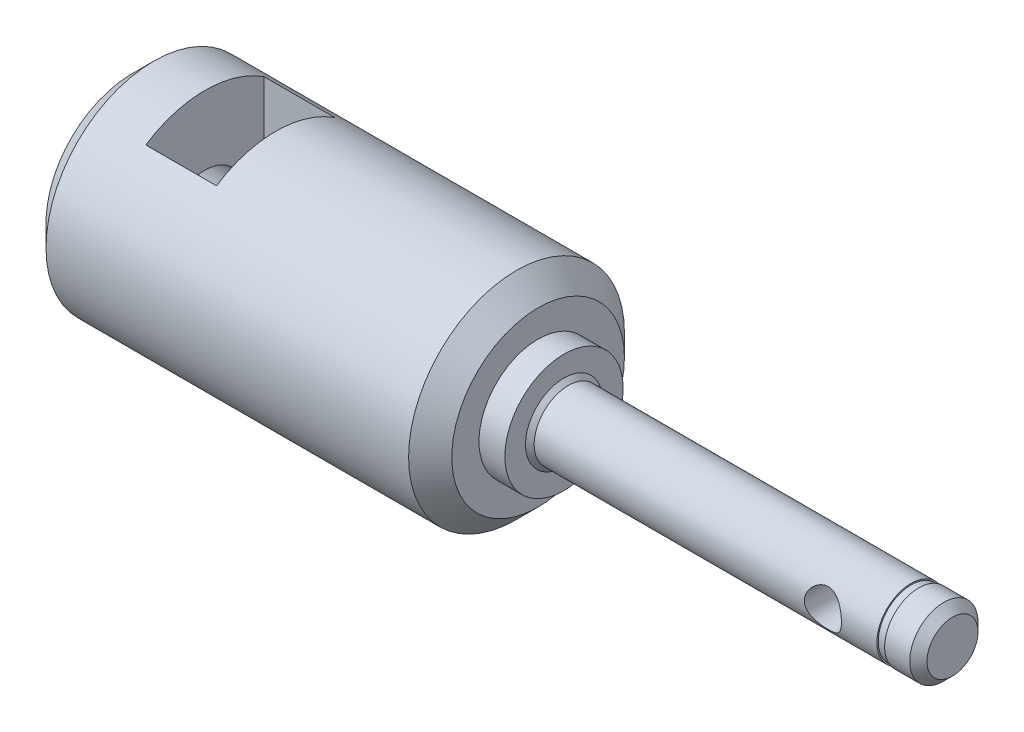
ISO-10303-21;
HEADER;
FILE_DESCRIPTION(('STEP AP214'),'2;1');
FILE_NAME('part.step','',(''),(''),'','','');
FILE_SCHEMA(('AUTOMOTIVE_DESIGN { 1 0 10303 214 1 1 1 1 }'));
ENDSEC;
DATA;
#1=APPLICATION_CONTEXT('core data for automotive mechanical design processes');
#2=APPLICATION_PROTOCOL_DEFINITION('international standard','automotive_design',2000,#1);
#3=PRODUCT_CONTEXT('',#1,'mechanical');
#4=PRODUCT('Part','Part','',(#3));
#5=PRODUCT_RELATED_PRODUCT_CATEGORY('part','',(#4));
#6=PRODUCT_DEFINITION_FORMATION('','',#4);
#7=PRODUCT_DEFINITION_CONTEXT('part definition',#1,'design');
#8=PRODUCT_DEFINITION('design','',#6,#7);
#9=PRODUCT_DEFINITION_SHAPE('','',#8);
#10=(LENGTH_UNIT() NAMED_UNIT(*) SI_UNIT(.MILLI.,.METRE.));
#11=(NAMED_UNIT(*) PLANE_ANGLE_UNIT() SI_UNIT($,.RADIAN.));
#12=(NAMED_UNIT(*) SI_UNIT($,.STERADIAN.) SOLID_ANGLE_UNIT());
#13=UNCERTAINTY_MEASURE_WITH_UNIT(LENGTH_MEASURE(1.E-05),#10,'distance_accuracy_value','');
#14=(GEOMETRIC_REPRESENTATION_CONTEXT(3) GLOBAL_UNCERTAINTY_ASSIGNED_CONTEXT((#13)) GLOBAL_UNIT_ASSIGNED_CONTEXT((#10,
#11,#12)) REPRESENTATION_CONTEXT('',''));
#15=CARTESIAN_POINT('',(0.,0.,0.));
#16=DIRECTION('',(0.,0.,1.));
#17=DIRECTION('',(1.,0.,0.));
#18=AXIS2_PLACEMENT_3D('',#15,#16,#17);
#19=CARTESIAN_POINT('',(45.,0.,0.));
#20=DIRECTION('',(-1.,0.,0.));
#21=DIRECTION('',(0.,0.,1.));
#22=AXIS2_PLACEMENT_3D('',#19,#20,#21);
#23=CYLINDRICAL_SURFACE('',#22,3.955);
#24=CARTESIAN_POINT('',(0.500000000000084,0.,0.));
#25=DIRECTION('',(1.,0.,0.));
#26=DIRECTION('',(0.,0.,-1.));
#27=AXIS2_PLACEMENT_3D('',#24,#25,#26);
#28=CIRCLE('',#27,3.955);
#29=CARTESIAN_POINT('',(0.500000000000084,0.,-3.955));
#30=VERTEX_POINT('',#29);
#31=EDGE_CURVE('E54',#30,#30,#28,.T.);
#32=ORIENTED_EDGE('',*,*,#31,.T.);
#33=EDGE_LOOP('',(#32));
#34=FACE_BOUND('',#33,.T.);
#35=CARTESIAN_POINT('',(36.09,0.,-3.955));
#36=CARTESIAN_POINT('',(36.0899913353575,0.11181063584012,-3.95499243223975));
#37=CARTESIAN_POINT('',(36.0812265055163,0.223723051403326,-3.95020937629344));
#38=CARTESIAN_POINT('',(36.0465883434407,0.444161006607524,-3.93154366621352));
#39=CARTESIAN_POINT('',(36.0206904459152,0.552681448543805,-3.91764794664675));
#40=CARTESIAN_POINT('',(35.9531374952778,0.762830990051214,-3.88219353760298));
#41=CARTESIAN_POINT('',(35.911546938014,0.864486315383245,-3.86066623505247));
#42=CARTESIAN_POINT('',(35.8141660617234,1.05917985222398,-3.8118567187839));
#43=CARTESIAN_POINT('',(35.7583753388594,1.15221781856178,-3.78457434140157));
#44=CARTESIAN_POINT('',(35.6299227092596,1.3341245832591,-3.72450288446028));
#45=CARTESIAN_POINT('',(35.5563737134341,1.42228360140012,-3.69146592463258));
#46=CARTESIAN_POINT('',(35.3964292445123,1.58568614584837,-3.62428543995537));
#47=CARTESIAN_POINT('',(35.3100221871021,1.66091789241436,-3.59014093920025));
#48=CARTESIAN_POINT('',(35.1169958420553,1.80359088411455,-3.52078940686454));
#49=CARTESIAN_POINT('',(35.0092336694647,1.86959797538891,-3.485793302945));
#50=CARTESIAN_POINT('',(34.7820063815533,1.9823056543699,-3.42296478861619));
#51=CARTESIAN_POINT('',(34.6625505408779,2.02902139166791,-3.39512676344169));
#52=CARTESIAN_POINT('',(34.4810748145664,2.08168106318247,-3.36288675129095));
#53=CARTESIAN_POINT('',(34.4222244334382,2.09610457644942,-3.35388823998415));
#54=CARTESIAN_POINT('',(34.3031643669255,2.11997390775354,-3.33885276912193));
#55=CARTESIAN_POINT('',(34.2429554933086,2.1294226204195,-3.33281408750678));
#56=CARTESIAN_POINT('',(34.1217682113817,2.14316944226478,-3.32399123212969));
#57=CARTESIAN_POINT('',(34.0607905489024,2.14747220552278,-3.32120411765464));
#58=CARTESIAN_POINT('',(33.9386501903377,2.1508686265174,-3.31900416954366));
#59=CARTESIAN_POINT('',(33.8774875194549,2.14996296441426,-3.31959089532314));
#60=CARTESIAN_POINT('',(33.7126975564287,2.1404709285362,-3.32573159418689));
#61=CARTESIAN_POINT('',(33.6094216945788,2.12693600133354,-3.33448537855423));
#62=CARTESIAN_POINT('',(33.4069986736786,2.08545408607942,-3.36057770955324));
#63=CARTESIAN_POINT('',(33.3078533269552,2.05750084227053,-3.37791998239114));
#64=CARTESIAN_POINT('',(33.1136567999618,1.98759647891917,-3.41952718762628));
#65=CARTESIAN_POINT('',(33.0187432451249,1.94535158906127,-3.44393570955849));
#66=CARTESIAN_POINT('',(32.8368702211833,1.84830880363638,-3.4969749528188));
#67=CARTESIAN_POINT('',(32.749914249567,1.79350542513589,-3.52560751637823));
#68=CARTESIAN_POINT('',(32.5723634542071,1.6631262215664,-3.58915894932989));
#69=CARTESIAN_POINT('',(32.4832604626013,1.58565285730952,-3.62436795415648));
#70=CARTESIAN_POINT('',(32.318625704345,1.41688194526972,-3.69361570126591));
#71=CARTESIAN_POINT('',(32.2431028297316,1.32557541131796,-3.7276536650618));
#72=CARTESIAN_POINT('',(32.1031228757089,1.12442363848674,-3.79335994355921));
#73=CARTESIAN_POINT('',(32.0396856626446,1.01376515088264,-3.82473643042661));
#74=CARTESIAN_POINT('',(31.9328850447521,0.781226880662589,-3.87890580520184));
#75=CARTESIAN_POINT('',(31.8895031297434,0.659357570243086,-3.90170660446289));
#76=CARTESIAN_POINT('',(31.8281078635875,0.419836128447885,-3.93433672282033));
#77=CARTESIAN_POINT('',(31.8081292500945,0.302825989676947,-3.94516569464654));
#78=CARTESIAN_POINT('',(31.7877728989182,0.066640695557453,-3.95620092179831));
#79=CARTESIAN_POINT('',(31.7873831060668,-0.0525330830842293,-3.9564137104351));
#80=CARTESIAN_POINT('',(31.8052912257121,-0.277559441251307,-3.94670329600794));
#81=CARTESIAN_POINT('',(31.8218171553956,-0.383601906852055,-3.93774118322879));
#82=CARTESIAN_POINT('',(31.8701193119344,-0.591141057732675,-3.91197066844202));
#83=CARTESIAN_POINT('',(31.9018970980258,-0.692637277078039,-3.89516146421104));
#84=CARTESIAN_POINT('',(31.980358084972,-0.891042890832165,-3.8546813162091));
#85=CARTESIAN_POINT('',(32.0273735192684,-0.987788788416986,-3.83085862832163));
#86=CARTESIAN_POINT('',(32.1345494279513,-1.17228135833838,-3.77849068500266));
#87=CARTESIAN_POINT('',(32.1947148369907,-1.26002463414359,-3.74994365769704));
#88=CARTESIAN_POINT('',(32.3340794541026,-1.43433181403964,-3.68703398140593));
#89=CARTESIAN_POINT('',(32.4146464102445,-1.51969707849559,-3.65237720005062));
#90=CARTESIAN_POINT('',(32.5886582765177,-1.67633547839038,-3.58319298844329));
#91=CARTESIAN_POINT('',(32.682115890799,-1.74759454089766,-3.54866572074452));
#92=CARTESIAN_POINT('',(32.8876960787111,-1.87912647833076,-3.4809162278637));
#93=CARTESIAN_POINT('',(33.0006864061808,-1.93820358392112,-3.44797743718148));
#94=CARTESIAN_POINT('',(33.2372706957762,-2.03592465619749,-3.39120413797061));
#95=CARTESIAN_POINT('',(33.3608490026322,-2.07459820538148,-3.36735646251482));
#96=CARTESIAN_POINT('',(33.6023990173185,-2.12655968614989,-3.33476103055512));
#97=CARTESIAN_POINT('',(33.7197424307738,-2.14195524051053,-3.32476763700887));
#98=CARTESIAN_POINT('',(33.9557182809619,-2.15317732122058,-3.31751632632435));
#99=CARTESIAN_POINT('',(34.0743496316829,-2.14901922389583,-3.3202484022941));
#100=CARTESIAN_POINT('',(34.2930343973038,-2.1232966448781,-3.33673532602036));
#101=CARTESIAN_POINT('',(34.3934928174628,-2.10407315582721,-3.34900603341765));
#102=CARTESIAN_POINT('',(34.5895483405185,-2.05204284441452,-3.38113510836181));
#103=CARTESIAN_POINT('',(34.6851435113652,-2.0192306701929,-3.40099646522341));
#104=CARTESIAN_POINT('',(34.8754876201626,-1.93873842034259,-3.44754988602101));
#105=CARTESIAN_POINT('',(34.9698086546846,-1.89025593293933,-3.4745918269835));
#106=CARTESIAN_POINT('',(35.1496094857022,-1.78057590832574,-3.53205456016513));
#107=CARTESIAN_POINT('',(35.2350845142385,-1.71937156700555,-3.56247715641279));
#108=CARTESIAN_POINT('',(35.4083476014451,-1.57512298129353,-3.62880417108258));
#109=CARTESIAN_POINT('',(35.4945090954418,-1.4901726832347,-3.6648384125703));
#110=CARTESIAN_POINT('',(35.6518812494208,-1.30637771687642,-3.73431058475788));
#111=CARTESIAN_POINT('',(35.7230815976057,-1.2075235433219,-3.7677467148012));
#112=CARTESIAN_POINT('',(35.8503368356612,-0.994446237578294,-3.82958415086532));
#113=CARTESIAN_POINT('',(35.9058619288541,-0.879845532965877,-3.85780020047228));
#114=CARTESIAN_POINT('',(35.9735423539584,-0.700916263962817,-3.89287304099152));
#115=CARTESIAN_POINT('',(35.9934942364712,-0.640139091272302,-3.90335146920138));
#116=CARTESIAN_POINT('',(36.0279748190733,-0.516681582141075,-3.9216000285076));
#117=CARTESIAN_POINT('',(36.0425064235906,-0.454002284472228,-3.92937160990568));
#118=CARTESIAN_POINT('',(36.0660709104973,-0.326468355543275,-3.94203018655783));
#119=CARTESIAN_POINT('',(36.07502919714,-0.261595977584929,-3.94687802395789));
#120=CARTESIAN_POINT('',(36.086996276686,-0.131160742943252,-3.95336514689983));
#121=CARTESIAN_POINT('',(36.0900050834363,-0.0655978878673112,-3.95500443990935));
#122=CARTESIAN_POINT('',(36.09,0.,-3.955));
#123=B_SPLINE_CURVE_WITH_KNOTS('',3,(#35,#36,#37,#38,#39,#40,#41,#42,#43,#44,#45,#46,#47,#48,
#49,#50,#51,#52,#53,#54,#55,#56,#57,#58,#59,#60,#61,#62,#63,#64,#65,#66,#67,#68,#69,#70,#71,#72,
#73,#74,#75,#76,#77,#78,#79,#80,#81,#82,#83,#84,#85,#86,#87,#88,#89,#90,#91,#92,#93,#94,#95,#96,
#97,#98,#99,#100,#101,#102,#103,#104,#105,#106,#107,#108,#109,#110,#111,#112,#113,#114,#115,
#116,#117,#118,#119,#120,#121,#122),.UNSPECIFIED.,.T.,.F.,(4,2,2,2,2,2,2,2,2,2,2,2,2,2,2,2,2,2,
2,2,2,2,2,2,2,2,2,2,2,2,2,2,2,2,2,2,2,2,2,2,2,2,2,4),(0.,0.335177404027916,0.670836428009941,
1.00513068131345,1.33943444264215,1.69639264403375,2.05367441176158,2.44514150195075,
2.83630058386944,3.01983248829485,3.20325748482003,3.38651646309838,3.56975151041227,
3.88170355660521,4.19379106520801,4.51272852526939,4.8318054970117,5.19988178048584,
5.56819820352995,5.96012796481195,6.35169526596605,6.70727127261125,7.06262845132601,
7.38422347765053,7.70585138845994,8.03502569712529,8.36432374431173,8.72996039758541,
9.09596000686924,9.48891726744081,9.88130321451063,10.2354278926941,10.5892741458767,
10.8969693720011,11.2047858983196,11.5318792974725,11.8591480902893,12.2362077578757,
12.6135264631718,13.0023848616934,13.1965889059074,13.3906887368724,13.5873335441659,
13.7839778937832),.UNSPECIFIED.);
#124=CARTESIAN_POINT('',(36.09,0.,-3.955));
#125=VERTEX_POINT('',#124);
#126=EDGE_CURVE('E128',#125,#125,#123,.T.);
#127=ORIENTED_EDGE('',*,*,#126,.T.);
#128=EDGE_LOOP('',(#127));
#129=FACE_BOUND('',#128,.T.);
#130=CARTESIAN_POINT('',(36.09,0.,3.955));
#131=CARTESIAN_POINT('',(36.0899913353575,-0.111810635840121,3.95499243223975));
#132=CARTESIAN_POINT('',(36.0812265055163,-0.223723051403327,3.95020937629344));
#133=CARTESIAN_POINT('',(36.0465883434407,-0.444161006607525,3.93154366621352));
#134=CARTESIAN_POINT('',(36.0206904459152,-0.552681448543806,3.91764794664675));
#135=CARTESIAN_POINT('',(35.9531374952778,-0.762830990051215,3.88219353760298));
#136=CARTESIAN_POINT('',(35.911546938014,-0.864486315383247,3.86066623505247));
#137=CARTESIAN_POINT('',(35.8141660617234,-1.05917985222398,3.8118567187839));
#138=CARTESIAN_POINT('',(35.7583753388594,-1.15221781856178,3.78457434140157));
#139=CARTESIAN_POINT('',(35.6299227092596,-1.3341245832591,3.72450288446028));
#140=CARTESIAN_POINT('',(35.5563737134341,-1.42228360140012,3.69146592463258));
#141=CARTESIAN_POINT('',(35.3964292445123,-1.58568614584837,3.62428543995537));
#142=CARTESIAN_POINT('',(35.3100221871021,-1.66091789241436,3.59014093920025));
#143=CARTESIAN_POINT('',(35.1169958420553,-1.80359088411455,3.52078940686454));
#144=CARTESIAN_POINT('',(35.0092336694647,-1.86959797538891,3.485793302945));
#145=CARTESIAN_POINT('',(34.7820063815533,-1.98230565436991,3.42296478861619));
#146=CARTESIAN_POINT('',(34.6625505408779,-2.02902139166791,3.39512676344169));
#147=CARTESIAN_POINT('',(34.4810748145664,-2.08168106318247,3.36288675129095));
#148=CARTESIAN_POINT('',(34.4222244334382,-2.09610457644942,3.35388823998414));
#149=CARTESIAN_POINT('',(34.3031643669255,-2.11997390775355,3.33885276912193));
#150=CARTESIAN_POINT('',(34.2429554933086,-2.12942262041951,3.33281408750678));
#151=CARTESIAN_POINT('',(34.1217682113817,-2.14316944226478,3.32399123212969));
#152=CARTESIAN_POINT('',(34.0607905489024,-2.14747220552279,3.32120411765463));
#153=CARTESIAN_POINT('',(33.9386501903377,-2.1508686265174,3.31900416954366));
#154=CARTESIAN_POINT('',(33.8774875194549,-2.14996296441426,3.31959089532314));
#155=CARTESIAN_POINT('',(33.7126975564287,-2.1404709285362,3.32573159418689));
#156=CARTESIAN_POINT('',(33.6094216945788,-2.12693600133355,3.33448537855423));
#157=CARTESIAN_POINT('',(33.4069986736786,-2.08545408607942,3.36057770955324));
#158=CARTESIAN_POINT('',(33.3078533269552,-2.05750084227054,3.37791998239114));
#159=CARTESIAN_POINT('',(33.1136567999618,-1.98759647891917,3.41952718762628));
#160=CARTESIAN_POINT('',(33.0187432451249,-1.94535158906127,3.44393570955849));
#161=CARTESIAN_POINT('',(32.8368702211833,-1.84830880363639,3.4969749528188));
#162=CARTESIAN_POINT('',(32.749914249567,-1.79350542513589,3.52560751637823));
#163=CARTESIAN_POINT('',(32.5723634542071,-1.6631262215664,3.58915894932989));
#164=CARTESIAN_POINT('',(32.4832604626013,-1.58565285730952,3.62436795415648));
#165=CARTESIAN_POINT('',(32.3186257043449,-1.41688194526972,3.69361570126591));
#166=CARTESIAN_POINT('',(32.2431028297316,-1.32557541131796,3.7276536650618));
#167=CARTESIAN_POINT('',(32.1031228757089,-1.12442363848675,3.79335994355921));
#168=CARTESIAN_POINT('',(32.0396856626446,-1.01376515088265,3.82473643042661));
#169=CARTESIAN_POINT('',(31.9328850447521,-0.781226880662598,3.87890580520184));
#170=CARTESIAN_POINT('',(31.8895031297435,-0.659357570243095,3.90170660446289));
#171=CARTESIAN_POINT('',(31.8281078635875,-0.419836128447894,3.93433672282032));
#172=CARTESIAN_POINT('',(31.8081292500945,-0.302825989676956,3.94516569464654));
#173=CARTESIAN_POINT('',(31.7877728989182,-0.0666406955574617,3.95620092179831));
#174=CARTESIAN_POINT('',(31.7873831060668,0.0525330830842215,3.9564137104351));
#175=CARTESIAN_POINT('',(31.8052912257121,0.2775594412513,3.94670329600794));
#176=CARTESIAN_POINT('',(31.8218171553956,0.383601906852049,3.93774118322879));
#177=CARTESIAN_POINT('',(31.8701193119344,0.59114105773267,3.91197066844202));
#178=CARTESIAN_POINT('',(31.9018970980258,0.692637277078033,3.89516146421104));
#179=CARTESIAN_POINT('',(31.980358084972,0.891042890832162,3.8546813162091));
#180=CARTESIAN_POINT('',(32.0273735192684,0.987788788416985,3.83085862832163));
#181=CARTESIAN_POINT('',(32.1345494279513,1.17228135833838,3.77849068500266));
#182=CARTESIAN_POINT('',(32.1947148369907,1.26002463414358,3.74994365769705));
#183=CARTESIAN_POINT('',(32.3340794541026,1.43433181403963,3.68703398140593));
#184=CARTESIAN_POINT('',(32.4146464102445,1.51969707849558,3.65237720005062));
#185=CARTESIAN_POINT('',(32.5886582765177,1.67633547839038,3.58319298844329));
#186=CARTESIAN_POINT('',(32.682115890799,1.74759454089765,3.54866572074452));
#187=CARTESIAN_POINT('',(32.8876960787111,1.87912647833075,3.4809162278637));
#188=CARTESIAN_POINT('',(33.0006864061808,1.93820358392111,3.44797743718148));
#189=CARTESIAN_POINT('',(33.2372706957762,2.03592465619748,3.39120413797061));
#190=CARTESIAN_POINT('',(33.3608490026322,2.07459820538148,3.36735646251482));
#191=CARTESIAN_POINT('',(33.6023990173185,2.12655968614988,3.33476103055512));
#192=CARTESIAN_POINT('',(33.7197424307738,2.14195524051053,3.32476763700887));
#193=CARTESIAN_POINT('',(33.9557182809619,2.15317732122058,3.31751632632435));
#194=CARTESIAN_POINT('',(34.0743496316829,2.14901922389583,3.3202484022941));
#195=CARTESIAN_POINT('',(34.2930343973038,2.1232966448781,3.33673532602036));
#196=CARTESIAN_POINT('',(34.3934928174628,2.10407315582721,3.34900603341765));
#197=CARTESIAN_POINT('',(34.5895483405185,2.05204284441451,3.38113510836181));
#198=CARTESIAN_POINT('',(34.6851435113652,2.01923067019289,3.40099646522341));
#199=CARTESIAN_POINT('',(34.8754876201626,1.93873842034259,3.44754988602101));
#200=CARTESIAN_POINT('',(34.9698086546846,1.89025593293933,3.4745918269835));
#201=CARTESIAN_POINT('',(35.1496094857022,1.78057590832574,3.53205456016513));
#202=CARTESIAN_POINT('',(35.2350845142385,1.71937156700555,3.56247715641279));
#203=CARTESIAN_POINT('',(35.4083476014451,1.57512298129353,3.62880417108258));
#204=CARTESIAN_POINT('',(35.4945090954418,1.4901726832347,3.66483841257029));
#205=CARTESIAN_POINT('',(35.6518812494208,1.30637771687642,3.73431058475787));
#206=CARTESIAN_POINT('',(35.7230815976057,1.2075235433219,3.7677467148012));
#207=CARTESIAN_POINT('',(35.8503368356612,0.99444623757829,3.82958415086532));
#208=CARTESIAN_POINT('',(35.9058619288541,0.879845532965872,3.85780020047228));
#209=CARTESIAN_POINT('',(35.9735423539584,0.700916263962813,3.89287304099152));
#210=CARTESIAN_POINT('',(35.9934942364712,0.640139091272298,3.90335146920138));
#211=CARTESIAN_POINT('',(36.0279748190733,0.516681582141072,3.9216000285076));
#212=CARTESIAN_POINT('',(36.0425064235906,0.454002284472225,3.92937160990568));
#213=CARTESIAN_POINT('',(36.0660709104973,0.326468355543273,3.94203018655783));
#214=CARTESIAN_POINT('',(36.07502919714,0.261595977584927,3.94687802395789));
#215=CARTESIAN_POINT('',(36.086996276686,0.13116074294325,3.95336514689983));
#216=CARTESIAN_POINT('',(36.0900050834363,0.0655978878673097,3.95500443990936));
#217=CARTESIAN_POINT('',(36.09,0.,3.955));
#218=B_SPLINE_CURVE_WITH_KNOTS('',3,(#130,#131,#132,#133,#134,#135,#136,#137,#138,#139,#140,
#141,#142,#143,#144,#145,#146,#147,#148,#149,#150,#151,#152,#153,#154,#155,#156,#157,#158,#159,
#160,#161,#162,#163,#164,#165,#166,#167,#168,#169,#170,#171,#172,#173,#174,#175,#176,#177,#178,
#179,#180,#181,#182,#183,#184,#185,#186,#187,#188,#189,#190,#191,#192,#193,#194,#195,#196,#197,
#198,#199,#200,#201,#202,#203,#204,#205,#206,#207,#208,#209,#210,#211,#212,#213,#214,#215,#216,
#217),.UNSPECIFIED.,.T.,.F.,(4,2,2,2,2,2,2,2,2,2,2,2,2,2,2,2,2,2,2,2,2,2,2,2,2,2,2,2,2,2,2,2,2,
2,2,2,2,2,2,2,2,2,2,4),(0.,0.335177404027916,0.670836428009941,1.00513068131345,
1.33943444264216,1.69639264403375,2.05367441176159,2.44514150195075,2.83630058386944,
3.01983248829486,3.20325748482004,3.38651646309838,3.56975151041227,3.88170355660521,
4.19379106520801,4.51272852526939,4.8318054970117,5.19988178048585,5.56819820352995,
5.96012796481194,6.35169526596604,6.70727127261125,7.06262845132601,7.38422347765053,
7.70585138845994,8.0350256971253,8.36432374431173,8.72996039758542,9.09596000686924,
9.48891726744081,9.88130321451063,10.2354278926941,10.5892741458767,10.8969693720011,
11.2047858983196,11.5318792974725,11.8591480902893,12.2362077578757,12.6135264631718,
13.0023848616934,13.1965889059074,13.3906887368725,13.5873335441659,13.7839778937832),.UNSPECIFIED.);
#219=CARTESIAN_POINT('',(36.09,0.,3.955));
#220=VERTEX_POINT('',#219);
#221=EDGE_CURVE('E127',#220,#220,#218,.T.);
#222=ORIENTED_EDGE('',*,*,#221,.T.);
#223=EDGE_LOOP('',(#222));
#224=FACE_BOUND('',#223,.T.);
#225=CARTESIAN_POINT('',(40.2,0.,0.));
#226=DIRECTION('',(1.,0.,0.));
#227=DIRECTION('',(0.,0.,-1.));
#228=AXIS2_PLACEMENT_3D('',#225,#226,#227);
#229=CIRCLE('',#228,3.955);
#230=CARTESIAN_POINT('',(40.2,0.,-3.955));
#231=VERTEX_POINT('',#230);
#232=EDGE_CURVE('E116',#231,#231,#229,.T.);
#233=ORIENTED_EDGE('',*,*,#232,.F.);
#234=EDGE_LOOP('',(#233));
#235=FACE_BOUND('',#234,.T.);
#236=ADVANCED_FACE('F45',(#34,#129,#224,#235),#23,.T.);
#237=CARTESIAN_POINT('',(-50.,0.,0.));
#238=DIRECTION('',(1.,0.,0.));
#239=DIRECTION('',(0.,0.,-1.));
#240=AXIS2_PLACEMENT_3D('',#237,#238,#239);
#241=CYLINDRICAL_SURFACE('',#240,12.5);
#242=CARTESIAN_POINT('',(-41.6,0.,0.));
#243=DIRECTION('',(-1.,0.,0.));
#244=DIRECTION('',(0.,0.,1.));
#245=AXIS2_PLACEMENT_3D('',#242,#243,#244);
#246=CIRCLE('',#245,12.5);
#247=CARTESIAN_POINT('',(-41.6,-10.4559791507061,6.85));
#248=VERTEX_POINT('',#247);
#249=CARTESIAN_POINT('',(-41.6,-10.4559791507061,-6.85));
#250=VERTEX_POINT('',#249);
#251=EDGE_CURVE('E99',#248,#250,#246,.F.);
#252=ORIENTED_EDGE('',*,*,#251,.F.);
#253=DIRECTION('',(1.,0.,0.));
#254=VECTOR('',#253,1.);
#255=CARTESIAN_POINT('',(-50.,-10.4559791507061,6.85));
#256=LINE('',#255,#254);
#257=CARTESIAN_POINT('',(-33.4,-10.4559791507061,6.85));
#258=VERTEX_POINT('',#257);
#259=EDGE_CURVE('E212',#258,#248,#256,.F.);
#260=ORIENTED_EDGE('',*,*,#259,.F.);
#261=CARTESIAN_POINT('',(-33.4,0.,0.));
#262=DIRECTION('',(1.,0.,0.));
#263=DIRECTION('',(0.,0.,-1.));
#264=AXIS2_PLACEMENT_3D('',#261,#262,#263);
#265=CIRCLE('',#264,12.5);
#266=CARTESIAN_POINT('',(-33.4,-10.4559791507061,-6.85));
#267=VERTEX_POINT('',#266);
#268=EDGE_CURVE('E208',#267,#258,#265,.F.);
#269=ORIENTED_EDGE('',*,*,#268,.F.);
#270=DIRECTION('',(1.,0.,0.));
#271=VECTOR('',#270,1.);
#272=CARTESIAN_POINT('',(-50.,-10.4559791507061,-6.85));
#273=LINE('',#272,#271);
#274=EDGE_CURVE('E210',#250,#267,#273,.T.);
#275=ORIENTED_EDGE('',*,*,#274,.F.);
#276=EDGE_LOOP('',(#252,#260,#269,#275));
#277=FACE_BOUND('',#276,.T.);
#278=CARTESIAN_POINT('',(-41.6,10.4559791507061,-6.85));
#279=VERTEX_POINT('',#278);
#280=CARTESIAN_POINT('',(-41.6,10.4559791507061,6.85));
#281=VERTEX_POINT('',#280);
#282=EDGE_CURVE('E88',#279,#281,#246,.F.);
#283=ORIENTED_EDGE('',*,*,#282,.F.);
#284=DIRECTION('',(1.,0.,0.));
#285=VECTOR('',#284,1.);
#286=CARTESIAN_POINT('',(-50.,10.4559791507061,-6.85));
#287=LINE('',#286,#285);
#288=CARTESIAN_POINT('',(-33.4,10.4559791507061,-6.85));
#289=VERTEX_POINT('',#288);
#290=EDGE_CURVE('E91',#289,#279,#287,.F.);
#291=ORIENTED_EDGE('',*,*,#290,.F.);
#292=CARTESIAN_POINT('',(-33.4,10.4559791507061,6.85));
#293=VERTEX_POINT('',#292);
#294=EDGE_CURVE('E101',#293,#289,#265,.F.);
#295=ORIENTED_EDGE('',*,*,#294,.F.);
#296=DIRECTION('',(1.,0.,0.));
#297=VECTOR('',#296,1.);
#298=CARTESIAN_POINT('',(-50.,10.4559791507061,6.85));
#299=LINE('',#298,#297);
#300=EDGE_CURVE('E93',#281,#293,#299,.T.);
#301=ORIENTED_EDGE('',*,*,#300,.F.);
#302=EDGE_LOOP('',(#283,#291,#295,#301));
#303=FACE_BOUND('',#302,.T.);
#304=CARTESIAN_POINT('',(-5.49999999999999,0.,0.));
#305=DIRECTION('',(1.,0.,0.));
#306=DIRECTION('',(0.,0.,-1.));
#307=AXIS2_PLACEMENT_3D('',#304,#305,#306);
#308=CIRCLE('',#307,12.5);
#309=CARTESIAN_POINT('',(-5.49999999999999,0.,-12.5));
#310=VERTEX_POINT('',#309);
#311=EDGE_CURVE('E200',#310,#310,#308,.F.);
#312=ORIENTED_EDGE('',*,*,#311,.T.);
#313=EDGE_LOOP('',(#312));
#314=FACE_BOUND('',#313,.T.);
#315=CARTESIAN_POINT('',(-47.5,0.,0.));
#316=DIRECTION('',(1.,0.,0.));
#317=DIRECTION('',(0.,0.,-1.));
#318=AXIS2_PLACEMENT_3D('',#315,#316,#317);
#319=CIRCLE('',#318,12.5);
#320=CARTESIAN_POINT('',(-47.5,0.,-12.5));
#321=VERTEX_POINT('',#320);
#322=EDGE_CURVE('E123',#321,#321,#319,.T.);
#323=ORIENTED_EDGE('',*,*,#322,.T.);
#324=EDGE_LOOP('',(#323));
#325=FACE_BOUND('',#324,.T.);
#326=ADVANCED_FACE('F89',(#277,#303,#314,#325),#241,.T.);
#327=CARTESIAN_POINT('',(-50.,0.,0.));
#328=DIRECTION('',(1.,0.,0.));
#329=DIRECTION('',(0.,0.,-1.));
#330=AXIS2_PLACEMENT_3D('',#327,#328,#329);
#331=PLANE('',#330);
#332=CARTESIAN_POINT('',(-50.,0.,0.));
#333=DIRECTION('',(-1.,0.,0.));
#334=DIRECTION('',(0.,0.,1.));
#335=AXIS2_PLACEMENT_3D('',#332,#333,#334);
#336=CIRCLE('',#335,4.5);
#337=CARTESIAN_POINT('',(-50.,0.,4.5));
#338=VERTEX_POINT('',#337);
#339=EDGE_CURVE('E223',#338,#338,#336,.T.);
#340=ORIENTED_EDGE('',*,*,#339,.F.);
#341=EDGE_LOOP('',(#340));
#342=FACE_BOUND('',#341,.T.);
#343=CARTESIAN_POINT('',(-50.,0.,0.));
#344=DIRECTION('',(1.,0.,0.));
#345=DIRECTION('',(0.,0.,-1.));
#346=AXIS2_PLACEMENT_3D('',#343,#344,#345);
#347=CIRCLE('',#346,10.);
#348=CARTESIAN_POINT('',(-50.,0.,-10.));
#349=VERTEX_POINT('',#348);
#350=EDGE_CURVE('E194',#349,#349,#347,.F.);
#351=ORIENTED_EDGE('',*,*,#350,.T.);
#352=EDGE_LOOP('',(#351));
#353=FACE_BOUND('',#352,.T.);
#354=ADVANCED_FACE('F175',(#342,#353),#331,.F.);
#355=CARTESIAN_POINT('',(-3.,0.,0.));
#356=DIRECTION('',(1.,0.,0.));
#357=DIRECTION('',(0.,0.,-1.));
#358=AXIS2_PLACEMENT_3D('',#355,#356,#357);
#359=PLANE('',#358);
#360=CARTESIAN_POINT('',(-3.,0.,0.));
#361=DIRECTION('',(1.,0.,0.));
#362=DIRECTION('',(0.,0.,-1.));
#363=AXIS2_PLACEMENT_3D('',#360,#361,#362);
#364=CIRCLE('',#363,10.);
#365=CARTESIAN_POINT('',(-3.,0.,-10.));
#366=VERTEX_POINT('',#365);
#367=EDGE_CURVE('E197',#366,#366,#364,.T.);
#368=ORIENTED_EDGE('',*,*,#367,.T.);
#369=EDGE_LOOP('',(#368));
#370=FACE_BOUND('',#369,.T.);
#371=CARTESIAN_POINT('',(-3.,0.,0.));
#372=DIRECTION('',(1.,0.,0.));
#373=DIRECTION('',(0.,0.,-1.));
#374=AXIS2_PLACEMENT_3D('',#371,#372,#373);
#375=CIRCLE('',#374,6.85);
#376=CARTESIAN_POINT('',(-3.,0.,-6.85));
#377=VERTEX_POINT('',#376);
#378=EDGE_CURVE('E120',#377,#377,#375,.T.);
#379=ORIENTED_EDGE('',*,*,#378,.F.);
#380=EDGE_LOOP('',(#379));
#381=FACE_BOUND('',#380,.T.);
#382=ADVANCED_FACE('F289',(#370,#381),#359,.T.);
#383=CARTESIAN_POINT('',(-3.,0.,0.));
#384=DIRECTION('',(1.,0.,0.));
#385=DIRECTION('',(0.,0.,-1.));
#386=AXIS2_PLACEMENT_3D('',#383,#384,#385);
#387=CYLINDRICAL_SURFACE('',#386,6.85);
#388=ORIENTED_EDGE('',*,*,#378,.T.);
#389=EDGE_LOOP('',(#388));
#390=FACE_BOUND('',#389,.T.);
#391=CARTESIAN_POINT('',(0.,0.,0.));
#392=DIRECTION('',(1.,0.,0.));
#393=DIRECTION('',(0.,0.,-1.));
#394=AXIS2_PLACEMENT_3D('',#391,#392,#393);
#395=CIRCLE('',#394,6.85);
#396=CARTESIAN_POINT('',(0.,0.,-6.85));
#397=VERTEX_POINT('',#396);
#398=EDGE_CURVE('E124',#397,#397,#395,.T.);
#399=ORIENTED_EDGE('',*,*,#398,.F.);
#400=EDGE_LOOP('',(#399));
#401=FACE_BOUND('',#400,.T.);
#402=ADVANCED_FACE('F294',(#390,#401),#387,.T.);
#403=CARTESIAN_POINT('',(0.,0.,0.));
#404=DIRECTION('',(1.,0.,0.));
#405=DIRECTION('',(0.,0.,-1.));
#406=AXIS2_PLACEMENT_3D('',#403,#404,#405);
#407=PLANE('',#406);
#408=CARTESIAN_POINT('',(0.,0.,0.));
#409=DIRECTION('',(1.,0.,0.));
#410=DIRECTION('',(0.,0.,-1.));
#411=AXIS2_PLACEMENT_3D('',#408,#409,#410);
#412=CIRCLE('',#411,4.45500000000008);
#413=CARTESIAN_POINT('',(0.,0.,-4.45500000000008));
#414=VERTEX_POINT('',#413);
#415=EDGE_CURVE('E12',#414,#414,#412,.F.);
#416=ORIENTED_EDGE('',*,*,#415,.T.);
#417=EDGE_LOOP('',(#416));
#418=FACE_BOUND('',#417,.T.);
#419=ORIENTED_EDGE('',*,*,#398,.T.);
#420=EDGE_LOOP('',(#419));
#421=FACE_BOUND('',#420,.T.);
#422=ADVANCED_FACE('F150',(#418,#421),#407,.T.);
#423=CARTESIAN_POINT('',(33.94,0.,-12.5));
#424=DIRECTION('',(0.,0.,1.));
#425=DIRECTION('',(1.,0.,0.));
#426=AXIS2_PLACEMENT_3D('',#423,#424,#425);
#427=CYLINDRICAL_SURFACE('',#426,2.15);
#428=ORIENTED_EDGE('',*,*,#126,.F.);
#429=EDGE_LOOP('',(#428));
#430=FACE_BOUND('',#429,.T.);
#431=ORIENTED_EDGE('',*,*,#221,.F.);
#432=EDGE_LOOP('',(#431));
#433=FACE_BOUND('',#432,.T.);
#434=ADVANCED_FACE('F145',(#430,#433),#427,.F.);
#435=CARTESIAN_POINT('',(41.1,0.,0.));
#436=DIRECTION('',(1.,0.,0.));
#437=DIRECTION('',(0.,0.,-1.));
#438=AXIS2_PLACEMENT_3D('',#435,#436,#437);
#439=PLANE('',#438);
#440=CARTESIAN_POINT('',(41.1,0.,0.));
#441=DIRECTION('',(1.,0.,0.));
#442=DIRECTION('',(0.,0.,-1.));
#443=AXIS2_PLACEMENT_3D('',#440,#441,#442);
#444=CIRCLE('',#443,3.8);
#445=CARTESIAN_POINT('',(41.1,0.,-3.8));
#446=VERTEX_POINT('',#445);
#447=EDGE_CURVE('E113',#446,#446,#444,.T.);
#448=ORIENTED_EDGE('',*,*,#447,.T.);
#449=EDGE_LOOP('',(#448));
#450=FACE_BOUND('',#449,.T.);
#451=CARTESIAN_POINT('',(41.1,0.,0.));
#452=DIRECTION('',(1.,0.,0.));
#453=DIRECTION('',(0.,0.,-1.));
#454=AXIS2_PLACEMENT_3D('',#451,#452,#453);
#455=CIRCLE('',#454,3.955);
#456=CARTESIAN_POINT('',(41.1,0.,-3.955));
#457=VERTEX_POINT('',#456);
#458=EDGE_CURVE('E136',#457,#457,#455,.T.);
#459=ORIENTED_EDGE('',*,*,#458,.F.);
#460=EDGE_LOOP('',(#459));
#461=FACE_BOUND('',#460,.T.);
#462=ADVANCED_FACE('F149',(#450,#461),#439,.F.);
#463=CARTESIAN_POINT('',(40.2,0.,0.));
#464=DIRECTION('',(1.,0.,0.));
#465=DIRECTION('',(0.,0.,-1.));
#466=AXIS2_PLACEMENT_3D('',#463,#464,#465);
#467=PLANE('',#466);
#468=CARTESIAN_POINT('',(40.2,0.,0.));
#469=DIRECTION('',(1.,0.,0.));
#470=DIRECTION('',(0.,0.,-1.));
#471=AXIS2_PLACEMENT_3D('',#468,#469,#470);
#472=CIRCLE('',#471,3.8);
#473=CARTESIAN_POINT('',(40.2,0.,-3.8));
#474=VERTEX_POINT('',#473);
#475=EDGE_CURVE('E117',#474,#474,#472,.T.);
#476=ORIENTED_EDGE('',*,*,#475,.F.);
#477=EDGE_LOOP('',(#476));
#478=FACE_BOUND('',#477,.T.);
#479=ORIENTED_EDGE('',*,*,#232,.T.);
#480=EDGE_LOOP('',(#479));
#481=FACE_BOUND('',#480,.T.);
#482=ADVANCED_FACE('F152',(#478,#481),#467,.T.);
#483=CARTESIAN_POINT('',(41.1,0.,0.));
#484=DIRECTION('',(-1.,0.,0.));
#485=DIRECTION('',(0.,0.,1.));
#486=AXIS2_PLACEMENT_3D('',#483,#484,#485);
#487=CYLINDRICAL_SURFACE('',#486,3.8);
#488=ORIENTED_EDGE('',*,*,#447,.F.);
#489=EDGE_LOOP('',(#488));
#490=FACE_BOUND('',#489,.T.);
#491=ORIENTED_EDGE('',*,*,#475,.T.);
#492=EDGE_LOOP('',(#491));
#493=FACE_BOUND('',#492,.T.);
#494=ADVANCED_FACE('F157',(#490,#493),#487,.T.);
#495=CARTESIAN_POINT('',(45.,0.,0.));
#496=DIRECTION('',(1.,0.,0.));
#497=DIRECTION('',(0.,0.,-1.));
#498=AXIS2_PLACEMENT_3D('',#495,#496,#497);
#499=PLANE('',#498);
#500=CARTESIAN_POINT('',(45.,0.,0.));
#501=DIRECTION('',(1.,0.,0.));
#502=DIRECTION('',(0.,0.,-1.));
#503=AXIS2_PLACEMENT_3D('',#500,#501,#502);
#504=CIRCLE('',#503,2.95500000000004);
#505=CARTESIAN_POINT('',(45.,0.,-2.95500000000004));
#506=VERTEX_POINT('',#505);
#507=EDGE_CURVE('E203',#506,#506,#504,.T.);
#508=ORIENTED_EDGE('',*,*,#507,.T.);
#509=EDGE_LOOP('',(#508));
#510=FACE_BOUND('',#509,.T.);
#511=ADVANCED_FACE('F154',(#510),#499,.T.);
#512=CARTESIAN_POINT('',(44.,0.,0.));
#513=DIRECTION('',(1.,0.,0.));
#514=DIRECTION('',(0.,0.,-1.));
#515=AXIS2_PLACEMENT_3D('',#512,#513,#514);
#516=CIRCLE('',#515,3.955);
#517=CARTESIAN_POINT('',(44.,0.,-3.955));
#518=VERTEX_POINT('',#517);
#519=EDGE_CURVE('E97',#518,#518,#516,.F.);
#520=ORIENTED_EDGE('',*,*,#519,.T.);
#521=EDGE_LOOP('',(#520));
#522=FACE_BOUND('',#521,.T.);
#523=ORIENTED_EDGE('',*,*,#458,.T.);
#524=EDGE_LOOP('',(#523));
#525=FACE_BOUND('',#524,.T.);
#526=ADVANCED_FACE('F141',(#522,#525),#23,.T.);
#527=CARTESIAN_POINT('',(-47.5,0.,0.));
#528=DIRECTION('',(1.,0.,0.));
#529=DIRECTION('',(0.,0.,-1.));
#530=AXIS2_PLACEMENT_3D('',#527,#528,#529);
#531=CONICAL_SURFACE('',#530,12.5,0.785398163397451);
#532=ORIENTED_EDGE('',*,*,#350,.F.);
#533=EDGE_LOOP('',(#532));
#534=FACE_BOUND('',#533,.T.);
#535=ORIENTED_EDGE('',*,*,#322,.F.);
#536=EDGE_LOOP('',(#535));
#537=FACE_BOUND('',#536,.T.);
#538=ADVANCED_FACE('F163',(#534,#537),#531,.T.);
#539=CARTESIAN_POINT('',(-3.,0.,0.));
#540=DIRECTION('',(-1.,0.,0.));
#541=DIRECTION('',(0.,0.,1.));
#542=AXIS2_PLACEMENT_3D('',#539,#540,#541);
#543=CONICAL_SURFACE('',#542,10.,0.785398163397449);
#544=ORIENTED_EDGE('',*,*,#311,.F.);
#545=EDGE_LOOP('',(#544));
#546=FACE_BOUND('',#545,.T.);
#547=ORIENTED_EDGE('',*,*,#367,.F.);
#548=EDGE_LOOP('',(#547));
#549=FACE_BOUND('',#548,.T.);
#550=ADVANCED_FACE('F280',(#546,#549),#543,.T.);
#551=CARTESIAN_POINT('',(45.,0.,0.));
#552=DIRECTION('',(-1.,0.,0.));
#553=DIRECTION('',(0.,0.,1.));
#554=AXIS2_PLACEMENT_3D('',#551,#552,#553);
#555=CONICAL_SURFACE('',#554,2.95500000000004,0.785398163397449);
#556=ORIENTED_EDGE('',*,*,#519,.F.);
#557=EDGE_LOOP('',(#556));
#558=FACE_BOUND('',#557,.T.);
#559=ORIENTED_EDGE('',*,*,#507,.F.);
#560=EDGE_LOOP('',(#559));
#561=FACE_BOUND('',#560,.T.);
#562=ADVANCED_FACE('F243',(#558,#561),#555,.T.);
#563=CARTESIAN_POINT('',(-33.4,-12.5,6.85));
#564=DIRECTION('',(1.,0.,0.));
#565=DIRECTION('',(0.,0.,-1.));
#566=AXIS2_PLACEMENT_3D('',#563,#564,#565);
#567=PLANE('',#566);
#568=CARTESIAN_POINT('',(-33.4,0.,0.));
#569=DIRECTION('',(1.,0.,0.));
#570=DIRECTION('',(0.,0.,-1.));
#571=AXIS2_PLACEMENT_3D('',#568,#569,#570);
#572=CIRCLE('',#571,4.5);
#573=CARTESIAN_POINT('',(-33.4,0.,-4.5));
#574=VERTEX_POINT('',#573);
#575=EDGE_CURVE('E109',#574,#574,#572,.T.);
#576=ORIENTED_EDGE('',*,*,#575,.T.);
#577=EDGE_LOOP('',(#576));
#578=FACE_BOUND('',#577,.T.);
#579=DIRECTION('',(0.,1.,0.));
#580=VECTOR('',#579,1.);
#581=CARTESIAN_POINT('',(-33.4,-12.5,-6.85));
#582=LINE('',#581,#580);
#583=EDGE_CURVE('E66',#267,#289,#582,.T.);
#584=ORIENTED_EDGE('',*,*,#583,.F.);
#585=ORIENTED_EDGE('',*,*,#268,.T.);
#586=DIRECTION('',(0.,1.,0.));
#587=VECTOR('',#586,1.);
#588=CARTESIAN_POINT('',(-33.4,-12.5,6.85));
#589=LINE('',#588,#587);
#590=EDGE_CURVE('E107',#258,#293,#589,.T.);
#591=ORIENTED_EDGE('',*,*,#590,.T.);
#592=ORIENTED_EDGE('',*,*,#294,.T.);
#593=EDGE_LOOP('',(#584,#585,#591,#592));
#594=FACE_BOUND('',#593,.T.);
#595=ADVANCED_FACE('F232',(#578,#594),#567,.F.);
#596=CARTESIAN_POINT('',(-41.6,-12.5,6.85));
#597=DIRECTION('',(0.,0.,1.));
#598=DIRECTION('',(1.,0.,0.));
#599=AXIS2_PLACEMENT_3D('',#596,#597,#598);
#600=PLANE('',#599);
#601=ORIENTED_EDGE('',*,*,#259,.T.);
#602=DIRECTION('',(0.,1.,0.));
#603=VECTOR('',#602,1.);
#604=CARTESIAN_POINT('',(-41.6,-12.5,6.85));
#605=LINE('',#604,#603);
#606=EDGE_CURVE('E105',#248,#281,#605,.T.);
#607=ORIENTED_EDGE('',*,*,#606,.T.);
#608=ORIENTED_EDGE('',*,*,#300,.T.);
#609=ORIENTED_EDGE('',*,*,#590,.F.);
#610=EDGE_LOOP('',(#601,#607,#608,#609));
#611=FACE_BOUND('',#610,.T.);
#612=ADVANCED_FACE('F235',(#611),#600,.F.);
#613=CARTESIAN_POINT('',(-41.6,-12.5,6.85));
#614=DIRECTION('',(-1.,0.,0.));
#615=DIRECTION('',(0.,0.,1.));
#616=AXIS2_PLACEMENT_3D('',#613,#614,#615);
#617=PLANE('',#616);
#618=CARTESIAN_POINT('',(-41.6,0.,0.));
#619=DIRECTION('',(-1.,0.,0.));
#620=DIRECTION('',(0.,0.,1.));
#621=AXIS2_PLACEMENT_3D('',#618,#619,#620);
#622=CIRCLE('',#621,4.5);
#623=CARTESIAN_POINT('',(-41.6,0.,4.5));
#624=VERTEX_POINT('',#623);
#625=EDGE_CURVE('E215',#624,#624,#622,.T.);
#626=ORIENTED_EDGE('',*,*,#625,.T.);
#627=EDGE_LOOP('',(#626));
#628=FACE_BOUND('',#627,.T.);
#629=ORIENTED_EDGE('',*,*,#606,.F.);
#630=ORIENTED_EDGE('',*,*,#251,.T.);
#631=DIRECTION('',(0.,1.,0.));
#632=VECTOR('',#631,1.);
#633=CARTESIAN_POINT('',(-41.6,-12.5,-6.85));
#634=LINE('',#633,#632);
#635=EDGE_CURVE('E61',#250,#279,#634,.T.);
#636=ORIENTED_EDGE('',*,*,#635,.T.);
#637=ORIENTED_EDGE('',*,*,#282,.T.);
#638=EDGE_LOOP('',(#629,#630,#636,#637));
#639=FACE_BOUND('',#638,.T.);
#640=ADVANCED_FACE('F103',(#628,#639),#617,.F.);
#641=CARTESIAN_POINT('',(-41.6,-12.5,-6.85));
#642=DIRECTION('',(0.,0.,-1.));
#643=DIRECTION('',(-1.,0.,0.));
#644=AXIS2_PLACEMENT_3D('',#641,#642,#643);
#645=PLANE('',#644);
#646=ORIENTED_EDGE('',*,*,#290,.T.);
#647=ORIENTED_EDGE('',*,*,#635,.F.);
#648=ORIENTED_EDGE('',*,*,#274,.T.);
#649=ORIENTED_EDGE('',*,*,#583,.T.);
#650=EDGE_LOOP('',(#646,#647,#648,#649));
#651=FACE_BOUND('',#650,.T.);
#652=ADVANCED_FACE('F100',(#651),#645,.F.);
#653=CARTESIAN_POINT('',(-33.,0.,0.));
#654=DIRECTION('',(-1.,0.,0.));
#655=DIRECTION('',(0.,0.,1.));
#656=AXIS2_PLACEMENT_3D('',#653,#654,#655);
#657=CYLINDRICAL_SURFACE('',#656,4.5);
#658=ORIENTED_EDGE('',*,*,#339,.T.);
#659=EDGE_LOOP('',(#658));
#660=FACE_BOUND('',#659,.T.);
#661=ORIENTED_EDGE('',*,*,#625,.F.);
#662=EDGE_LOOP('',(#661));
#663=FACE_BOUND('',#662,.T.);
#664=ADVANCED_FACE('F251',(#660,#663),#657,.F.);
#665=CARTESIAN_POINT('',(-33.,0.,0.));
#666=DIRECTION('',(-1.,0.,0.));
#667=DIRECTION('',(0.,0.,1.));
#668=AXIS2_PLACEMENT_3D('',#665,#666,#667);
#669=CIRCLE('',#668,4.5);
#670=CARTESIAN_POINT('',(-33.,0.,4.5));
#671=VERTEX_POINT('',#670);
#672=EDGE_CURVE('E217',#671,#671,#669,.T.);
#673=ORIENTED_EDGE('',*,*,#672,.F.);
#674=EDGE_LOOP('',(#673));
#675=FACE_BOUND('',#674,.T.);
#676=ORIENTED_EDGE('',*,*,#575,.F.);
#677=EDGE_LOOP('',(#676));
#678=FACE_BOUND('',#677,.T.);
#679=ADVANCED_FACE('F247',(#675,#678),#657,.F.);
#680=CARTESIAN_POINT('',(-33.,0.,0.));
#681=DIRECTION('',(-1.,0.,0.));
#682=DIRECTION('',(0.,0.,1.));
#683=AXIS2_PLACEMENT_3D('',#680,#681,#682);
#684=PLANE('',#683);
#685=ORIENTED_EDGE('',*,*,#672,.T.);
#686=EDGE_LOOP('',(#685));
#687=FACE_BOUND('',#686,.T.);
#688=ADVANCED_FACE('F387',(#687),#684,.T.);
#689=CARTESIAN_POINT('',(0.500000000000084,0.,0.));
#690=DIRECTION('',(-1.,0.,0.));
#691=DIRECTION('',(0.,0.,1.));
#692=AXIS2_PLACEMENT_3D('',#689,#690,#691);
#693=CONICAL_SURFACE('',#692,3.955,0.785398163397448);
#694=ORIENTED_EDGE('',*,*,#415,.F.);
#695=EDGE_LOOP('',(#694));
#696=FACE_BOUND('',#695,.T.);
#697=ORIENTED_EDGE('',*,*,#31,.F.);
#698=EDGE_LOOP('',(#697));
#699=FACE_BOUND('',#698,.T.);
#700=ADVANCED_FACE('F48',(#696,#699),#693,.T.);
#701=CLOSED_SHELL('',(#236,#326,#354,#382,#402,#422,#434,#462,#482,#494,#511,#526,#538,#550,
#562,#595,#612,#640,#652,#664,#679,#688,#700));
#702=MANIFOLD_SOLID_BREP('B2',#701);
#703=ADVANCED_BREP_SHAPE_REPRESENTATION('',(#18,#702),#14);
#704=SHAPE_DEFINITION_REPRESENTATION(#9,#703);
ENDSEC;
END-ISO-10303-21;
